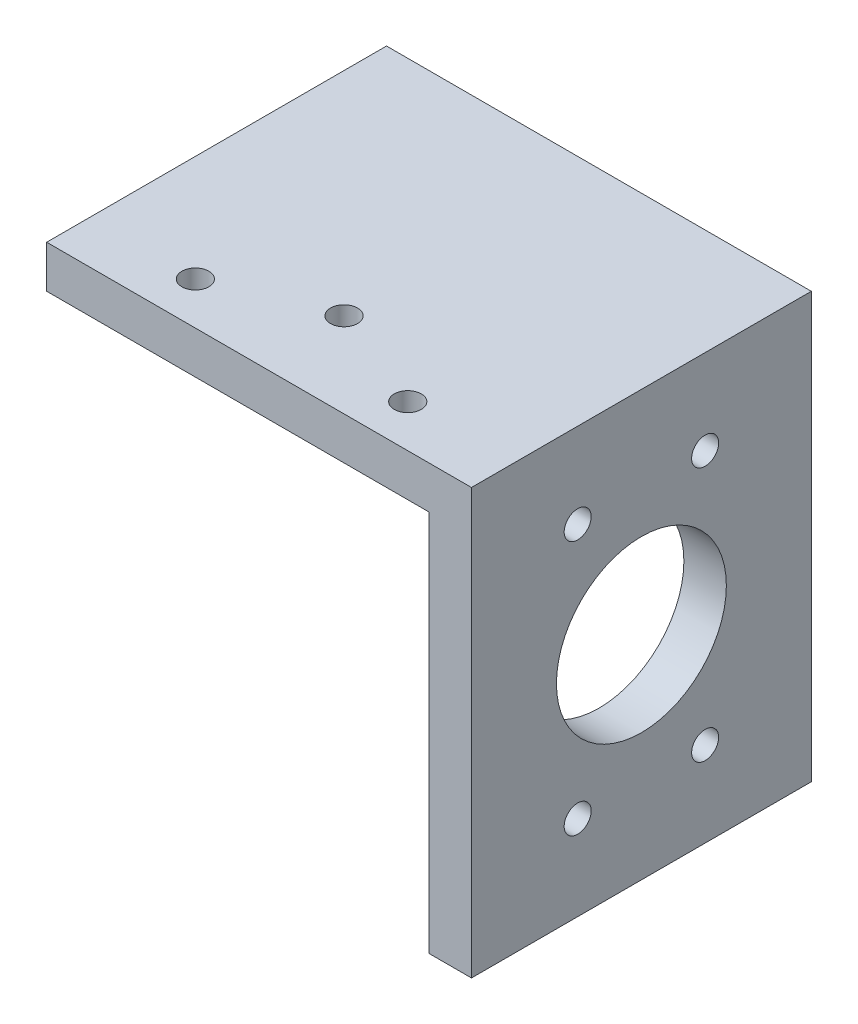
ISO-10303-21;
HEADER;
FILE_DESCRIPTION(('STEP AP214'),'2;1');
FILE_NAME('part.step','',(''),(''),'','','');
FILE_SCHEMA(('AUTOMOTIVE_DESIGN { 1 0 10303 214 1 1 1 1 }'));
ENDSEC;
DATA;
#1=APPLICATION_CONTEXT('core data for automotive mechanical design processes');
#2=APPLICATION_PROTOCOL_DEFINITION('international standard','automotive_design',2000,#1);
#3=PRODUCT_CONTEXT('',#1,'mechanical');
#4=PRODUCT('Part','Part','',(#3));
#5=PRODUCT_RELATED_PRODUCT_CATEGORY('part','',(#4));
#6=PRODUCT_DEFINITION_FORMATION('','',#4);
#7=PRODUCT_DEFINITION_CONTEXT('part definition',#1,'design');
#8=PRODUCT_DEFINITION('design','',#6,#7);
#9=PRODUCT_DEFINITION_SHAPE('','',#8);
#10=(LENGTH_UNIT() NAMED_UNIT(*) SI_UNIT(.MILLI.,.METRE.));
#11=(NAMED_UNIT(*) PLANE_ANGLE_UNIT() SI_UNIT($,.RADIAN.));
#12=(NAMED_UNIT(*) SI_UNIT($,.STERADIAN.) SOLID_ANGLE_UNIT());
#13=UNCERTAINTY_MEASURE_WITH_UNIT(LENGTH_MEASURE(1.E-05),#10,'distance_accuracy_value','');
#14=(GEOMETRIC_REPRESENTATION_CONTEXT(3) GLOBAL_UNCERTAINTY_ASSIGNED_CONTEXT((#13)) GLOBAL_UNIT_ASSIGNED_CONTEXT((#10,
#11,#12)) REPRESENTATION_CONTEXT('',''));
#15=CARTESIAN_POINT('',(0.,0.,0.));
#16=DIRECTION('',(0.,0.,1.));
#17=DIRECTION('',(1.,0.,0.));
#18=AXIS2_PLACEMENT_3D('',#15,#16,#17);
#19=CARTESIAN_POINT('',(0.,0.,50.8));
#20=DIRECTION('',(0.,-1.,0.));
#21=DIRECTION('',(0.,0.,-1.));
#22=AXIS2_PLACEMENT_3D('',#19,#20,#21);
#23=PLANE('',#22);
#24=CARTESIAN_POINT('',(47.625,0.,44.45));
#25=DIRECTION('',(0.,1.,0.));
#26=DIRECTION('',(0.,0.,1.));
#27=AXIS2_PLACEMENT_3D('',#24,#25,#26);
#28=CIRCLE('',#27,2.01929999999999);
#29=CARTESIAN_POINT('',(47.625,0.,46.4693));
#30=VERTEX_POINT('',#29);
#31=EDGE_CURVE('E254',#30,#30,#28,.T.);
#32=ORIENTED_EDGE('',*,*,#31,.F.);
#33=EDGE_LOOP('',(#32));
#34=FACE_BOUND('',#33,.T.);
#35=CARTESIAN_POINT('',(31.75,0.,38.1));
#36=DIRECTION('',(0.,1.,0.));
#37=DIRECTION('',(0.,0.,1.));
#38=AXIS2_PLACEMENT_3D('',#35,#36,#37);
#39=CIRCLE('',#38,2.01929999999999);
#40=CARTESIAN_POINT('',(31.75,0.,40.1193));
#41=VERTEX_POINT('',#40);
#42=EDGE_CURVE('E160',#41,#41,#39,.T.);
#43=ORIENTED_EDGE('',*,*,#42,.F.);
#44=EDGE_LOOP('',(#43));
#45=FACE_BOUND('',#44,.T.);
#46=DIRECTION('',(-1.,0.,0.));
#47=VECTOR('',#46,1.);
#48=CARTESIAN_POINT('',(0.,0.,0.));
#49=LINE('',#48,#47);
#50=CARTESIAN_POINT('',(63.5,0.,0.));
#51=VERTEX_POINT('',#50);
#52=CARTESIAN_POINT('',(0.,0.,0.));
#53=VERTEX_POINT('',#52);
#54=EDGE_CURVE('E82',#51,#53,#49,.T.);
#55=ORIENTED_EDGE('',*,*,#54,.T.);
#56=DIRECTION('',(0.,0.,-1.));
#57=VECTOR('',#56,1.);
#58=CARTESIAN_POINT('',(0.,0.,50.8));
#59=LINE('',#58,#57);
#60=CARTESIAN_POINT('',(0.,0.,50.8));
#61=VERTEX_POINT('',#60);
#62=EDGE_CURVE('E117',#61,#53,#59,.T.);
#63=ORIENTED_EDGE('',*,*,#62,.F.);
#64=DIRECTION('',(-1.,0.,0.));
#65=VECTOR('',#64,1.);
#66=CARTESIAN_POINT('',(0.,0.,50.8));
#67=LINE('',#66,#65);
#68=CARTESIAN_POINT('',(63.5,0.,50.8));
#69=VERTEX_POINT('',#68);
#70=EDGE_CURVE('E53',#69,#61,#67,.T.);
#71=ORIENTED_EDGE('',*,*,#70,.F.);
#72=DIRECTION('',(0.,0.,-1.));
#73=VECTOR('',#72,1.);
#74=CARTESIAN_POINT('',(63.5,0.,50.8));
#75=LINE('',#74,#73);
#76=EDGE_CURVE('E113',#69,#51,#75,.T.);
#77=ORIENTED_EDGE('',*,*,#76,.T.);
#78=EDGE_LOOP('',(#55,#63,#71,#77));
#79=FACE_BOUND('',#78,.T.);
#80=CARTESIAN_POINT('',(15.875,0.,44.45));
#81=DIRECTION('',(0.,1.,0.));
#82=DIRECTION('',(0.,0.,1.));
#83=AXIS2_PLACEMENT_3D('',#80,#81,#82);
#84=CIRCLE('',#83,2.01929999999999);
#85=CARTESIAN_POINT('',(15.875,0.,46.4693));
#86=VERTEX_POINT('',#85);
#87=EDGE_CURVE('E151',#86,#86,#84,.T.);
#88=ORIENTED_EDGE('',*,*,#87,.F.);
#89=EDGE_LOOP('',(#88));
#90=FACE_BOUND('',#89,.T.);
#91=ADVANCED_FACE('F36',(#34,#45,#79,#90),#23,.F.);
#92=CARTESIAN_POINT('',(0.,-6.35,50.8));
#93=DIRECTION('',(1.,0.,0.));
#94=DIRECTION('',(0.,0.,-1.));
#95=AXIS2_PLACEMENT_3D('',#92,#93,#94);
#96=PLANE('',#95);
#97=DIRECTION('',(0.,-1.,0.));
#98=VECTOR('',#97,1.);
#99=CARTESIAN_POINT('',(0.,-6.35,0.));
#100=LINE('',#99,#98);
#101=CARTESIAN_POINT('',(0.,-6.35,0.));
#102=VERTEX_POINT('',#101);
#103=EDGE_CURVE('E121',#53,#102,#100,.T.);
#104=ORIENTED_EDGE('',*,*,#103,.T.);
#105=DIRECTION('',(0.,0.,-1.));
#106=VECTOR('',#105,1.);
#107=CARTESIAN_POINT('',(0.,-6.35,50.8));
#108=LINE('',#107,#106);
#109=CARTESIAN_POINT('',(0.,-6.35,50.8));
#110=VERTEX_POINT('',#109);
#111=EDGE_CURVE('E11',#110,#102,#108,.T.);
#112=ORIENTED_EDGE('',*,*,#111,.F.);
#113=DIRECTION('',(0.,-1.,0.));
#114=VECTOR('',#113,1.);
#115=CARTESIAN_POINT('',(0.,-6.35,50.8));
#116=LINE('',#115,#114);
#117=EDGE_CURVE('E132',#61,#110,#116,.T.);
#118=ORIENTED_EDGE('',*,*,#117,.F.);
#119=ORIENTED_EDGE('',*,*,#62,.T.);
#120=EDGE_LOOP('',(#104,#112,#118,#119));
#121=FACE_BOUND('',#120,.T.);
#122=ADVANCED_FACE('F38',(#121),#96,.F.);
#123=CARTESIAN_POINT('',(57.15,-6.35,50.8));
#124=DIRECTION('',(0.,1.,0.));
#125=DIRECTION('',(-1.,0.,0.));
#126=AXIS2_PLACEMENT_3D('',#123,#124,#125);
#127=PLANE('',#126);
#128=CARTESIAN_POINT('',(47.625,-6.35,44.45));
#129=DIRECTION('',(0.,1.,0.));
#130=DIRECTION('',(-1.,0.,0.));
#131=AXIS2_PLACEMENT_3D('',#128,#129,#130);
#132=CIRCLE('',#131,2.01929999999999);
#133=CARTESIAN_POINT('',(45.6057,-6.35,44.45));
#134=VERTEX_POINT('',#133);
#135=EDGE_CURVE('E251',#134,#134,#132,.T.);
#136=ORIENTED_EDGE('',*,*,#135,.T.);
#137=EDGE_LOOP('',(#136));
#138=FACE_BOUND('',#137,.T.);
#139=CARTESIAN_POINT('',(31.75,-6.35,38.1));
#140=DIRECTION('',(0.,1.,0.));
#141=DIRECTION('',(-1.,0.,0.));
#142=AXIS2_PLACEMENT_3D('',#139,#140,#141);
#143=CIRCLE('',#142,2.01929999999999);
#144=CARTESIAN_POINT('',(29.7307,-6.35,38.1));
#145=VERTEX_POINT('',#144);
#146=EDGE_CURVE('E154',#145,#145,#143,.T.);
#147=ORIENTED_EDGE('',*,*,#146,.T.);
#148=EDGE_LOOP('',(#147));
#149=FACE_BOUND('',#148,.T.);
#150=CARTESIAN_POINT('',(15.875,-6.35,44.45));
#151=DIRECTION('',(0.,1.,0.));
#152=DIRECTION('',(-1.,0.,0.));
#153=AXIS2_PLACEMENT_3D('',#150,#151,#152);
#154=CIRCLE('',#153,2.01929999999999);
#155=CARTESIAN_POINT('',(13.8557,-6.35,44.45));
#156=VERTEX_POINT('',#155);
#157=EDGE_CURVE('E153',#156,#156,#154,.T.);
#158=ORIENTED_EDGE('',*,*,#157,.T.);
#159=EDGE_LOOP('',(#158));
#160=FACE_BOUND('',#159,.T.);
#161=DIRECTION('',(1.,0.,0.));
#162=VECTOR('',#161,1.);
#163=CARTESIAN_POINT('',(57.15,-6.35,0.));
#164=LINE('',#163,#162);
#165=CARTESIAN_POINT('',(57.15,-6.35,0.));
#166=VERTEX_POINT('',#165);
#167=EDGE_CURVE('E124',#102,#166,#164,.T.);
#168=ORIENTED_EDGE('',*,*,#167,.T.);
#169=DIRECTION('',(0.,0.,-1.));
#170=VECTOR('',#169,1.);
#171=CARTESIAN_POINT('',(57.15,-6.35,50.8));
#172=LINE('',#171,#170);
#173=CARTESIAN_POINT('',(57.15,-6.35,50.8));
#174=VERTEX_POINT('',#173);
#175=EDGE_CURVE('E45',#174,#166,#172,.T.);
#176=ORIENTED_EDGE('',*,*,#175,.F.);
#177=DIRECTION('',(1.,0.,0.));
#178=VECTOR('',#177,1.);
#179=CARTESIAN_POINT('',(57.15,-6.35,50.8));
#180=LINE('',#179,#178);
#181=EDGE_CURVE('E90',#110,#174,#180,.T.);
#182=ORIENTED_EDGE('',*,*,#181,.F.);
#183=ORIENTED_EDGE('',*,*,#111,.T.);
#184=EDGE_LOOP('',(#168,#176,#182,#183));
#185=FACE_BOUND('',#184,.T.);
#186=ADVANCED_FACE('F198',(#138,#149,#160,#185),#127,.F.);
#187=CARTESIAN_POINT('',(57.15,-63.5,50.8));
#188=DIRECTION('',(1.,0.,0.));
#189=DIRECTION('',(0.,1.,0.));
#190=AXIS2_PLACEMENT_3D('',#187,#188,#189);
#191=PLANE('',#190);
#192=CARTESIAN_POINT('',(57.15,-50.8,34.925));
#193=DIRECTION('',(1.,0.,0.));
#194=DIRECTION('',(0.,1.,0.));
#195=AXIS2_PLACEMENT_3D('',#192,#193,#194);
#196=CIRCLE('',#195,2.01929999999999);
#197=CARTESIAN_POINT('',(57.15,-48.7807,34.925));
#198=VERTEX_POINT('',#197);
#199=EDGE_CURVE('E166',#198,#198,#196,.T.);
#200=ORIENTED_EDGE('',*,*,#199,.T.);
#201=EDGE_LOOP('',(#200));
#202=FACE_BOUND('',#201,.T.);
#203=CARTESIAN_POINT('',(57.15,-50.8,15.875));
#204=DIRECTION('',(1.,0.,0.));
#205=DIRECTION('',(0.,1.,0.));
#206=AXIS2_PLACEMENT_3D('',#203,#204,#205);
#207=CIRCLE('',#206,2.01929999999999);
#208=CARTESIAN_POINT('',(57.15,-48.7807,15.875));
#209=VERTEX_POINT('',#208);
#210=EDGE_CURVE('E172',#209,#209,#207,.T.);
#211=ORIENTED_EDGE('',*,*,#210,.T.);
#212=EDGE_LOOP('',(#211));
#213=FACE_BOUND('',#212,.T.);
#214=CARTESIAN_POINT('',(57.15,-12.7,34.925));
#215=DIRECTION('',(1.,0.,0.));
#216=DIRECTION('',(0.,1.,0.));
#217=AXIS2_PLACEMENT_3D('',#214,#215,#216);
#218=CIRCLE('',#217,2.01929999999999);
#219=CARTESIAN_POINT('',(57.15,-10.6807,34.925));
#220=VERTEX_POINT('',#219);
#221=EDGE_CURVE('E178',#220,#220,#218,.T.);
#222=ORIENTED_EDGE('',*,*,#221,.T.);
#223=EDGE_LOOP('',(#222));
#224=FACE_BOUND('',#223,.T.);
#225=CARTESIAN_POINT('',(57.15,-12.7,15.875));
#226=DIRECTION('',(1.,0.,0.));
#227=DIRECTION('',(0.,1.,0.));
#228=AXIS2_PLACEMENT_3D('',#225,#226,#227);
#229=CIRCLE('',#228,2.01929999999999);
#230=CARTESIAN_POINT('',(57.15,-10.6807,15.875));
#231=VERTEX_POINT('',#230);
#232=EDGE_CURVE('E184',#231,#231,#229,.T.);
#233=ORIENTED_EDGE('',*,*,#232,.T.);
#234=EDGE_LOOP('',(#233));
#235=FACE_BOUND('',#234,.T.);
#236=CARTESIAN_POINT('',(57.15,-31.75,25.4));
#237=DIRECTION('',(1.,0.,0.));
#238=DIRECTION('',(0.,1.,0.));
#239=AXIS2_PLACEMENT_3D('',#236,#237,#238);
#240=CIRCLE('',#239,12.7);
#241=CARTESIAN_POINT('',(57.15,-19.05,25.4));
#242=VERTEX_POINT('',#241);
#243=EDGE_CURVE('E125',#242,#242,#240,.F.);
#244=ORIENTED_EDGE('',*,*,#243,.F.);
#245=EDGE_LOOP('',(#244));
#246=FACE_BOUND('',#245,.T.);
#247=DIRECTION('',(0.,-1.,0.));
#248=VECTOR('',#247,1.);
#249=CARTESIAN_POINT('',(57.15,-63.5,0.));
#250=LINE('',#249,#248);
#251=CARTESIAN_POINT('',(57.15,-63.5,0.));
#252=VERTEX_POINT('',#251);
#253=EDGE_CURVE('E127',#166,#252,#250,.T.);
#254=ORIENTED_EDGE('',*,*,#253,.T.);
#255=DIRECTION('',(0.,0.,-1.));
#256=VECTOR('',#255,1.);
#257=CARTESIAN_POINT('',(57.15,-63.5,50.8));
#258=LINE('',#257,#256);
#259=CARTESIAN_POINT('',(57.15,-63.5,50.8));
#260=VERTEX_POINT('',#259);
#261=EDGE_CURVE('E112',#260,#252,#258,.T.);
#262=ORIENTED_EDGE('',*,*,#261,.F.);
#263=DIRECTION('',(0.,-1.,0.));
#264=VECTOR('',#263,1.);
#265=CARTESIAN_POINT('',(57.15,-63.5,50.8));
#266=LINE('',#265,#264);
#267=EDGE_CURVE('E103',#174,#260,#266,.T.);
#268=ORIENTED_EDGE('',*,*,#267,.F.);
#269=ORIENTED_EDGE('',*,*,#175,.T.);
#270=EDGE_LOOP('',(#254,#262,#268,#269));
#271=FACE_BOUND('',#270,.T.);
#272=ADVANCED_FACE('F138',(#202,#213,#224,#235,#246,#271),#191,.F.);
#273=CARTESIAN_POINT('',(63.5,-63.5,50.8));
#274=DIRECTION('',(0.,1.,0.));
#275=DIRECTION('',(0.,0.,1.));
#276=AXIS2_PLACEMENT_3D('',#273,#274,#275);
#277=PLANE('',#276);
#278=DIRECTION('',(1.,0.,0.));
#279=VECTOR('',#278,1.);
#280=CARTESIAN_POINT('',(63.5,-63.5,0.));
#281=LINE('',#280,#279);
#282=CARTESIAN_POINT('',(63.5,-63.5,0.));
#283=VERTEX_POINT('',#282);
#284=EDGE_CURVE('E111',#252,#283,#281,.T.);
#285=ORIENTED_EDGE('',*,*,#284,.T.);
#286=DIRECTION('',(0.,0.,-1.));
#287=VECTOR('',#286,1.);
#288=CARTESIAN_POINT('',(63.5,-63.5,50.8));
#289=LINE('',#288,#287);
#290=CARTESIAN_POINT('',(63.5,-63.5,50.8));
#291=VERTEX_POINT('',#290);
#292=EDGE_CURVE('E108',#291,#283,#289,.T.);
#293=ORIENTED_EDGE('',*,*,#292,.F.);
#294=DIRECTION('',(1.,0.,0.));
#295=VECTOR('',#294,1.);
#296=CARTESIAN_POINT('',(63.5,-63.5,50.8));
#297=LINE('',#296,#295);
#298=EDGE_CURVE('E97',#260,#291,#297,.T.);
#299=ORIENTED_EDGE('',*,*,#298,.F.);
#300=ORIENTED_EDGE('',*,*,#261,.T.);
#301=EDGE_LOOP('',(#285,#293,#299,#300));
#302=FACE_BOUND('',#301,.T.);
#303=ADVANCED_FACE('F109',(#302),#277,.F.);
#304=CARTESIAN_POINT('',(63.5,0.,50.8));
#305=DIRECTION('',(-1.,0.,0.));
#306=DIRECTION('',(0.,-1.,0.));
#307=AXIS2_PLACEMENT_3D('',#304,#305,#306);
#308=PLANE('',#307);
#309=CARTESIAN_POINT('',(63.5,-50.8,34.925));
#310=DIRECTION('',(1.,0.,0.));
#311=DIRECTION('',(0.,0.,-1.));
#312=AXIS2_PLACEMENT_3D('',#309,#310,#311);
#313=CIRCLE('',#312,2.01929999999999);
#314=CARTESIAN_POINT('',(63.5,-50.8,32.9057));
#315=VERTEX_POINT('',#314);
#316=EDGE_CURVE('E157',#315,#315,#313,.T.);
#317=ORIENTED_EDGE('',*,*,#316,.F.);
#318=EDGE_LOOP('',(#317));
#319=FACE_BOUND('',#318,.T.);
#320=CARTESIAN_POINT('',(63.5,-50.8,15.875));
#321=DIRECTION('',(1.,0.,0.));
#322=DIRECTION('',(0.,0.,-1.));
#323=AXIS2_PLACEMENT_3D('',#320,#321,#322);
#324=CIRCLE('',#323,2.01929999999999);
#325=CARTESIAN_POINT('',(63.5,-50.8,13.8557));
#326=VERTEX_POINT('',#325);
#327=EDGE_CURVE('E169',#326,#326,#324,.T.);
#328=ORIENTED_EDGE('',*,*,#327,.F.);
#329=EDGE_LOOP('',(#328));
#330=FACE_BOUND('',#329,.T.);
#331=CARTESIAN_POINT('',(63.5,-12.7,34.925));
#332=DIRECTION('',(1.,0.,0.));
#333=DIRECTION('',(0.,0.,-1.));
#334=AXIS2_PLACEMENT_3D('',#331,#332,#333);
#335=CIRCLE('',#334,2.01929999999999);
#336=CARTESIAN_POINT('',(63.5,-12.7,32.9057));
#337=VERTEX_POINT('',#336);
#338=EDGE_CURVE('E175',#337,#337,#335,.T.);
#339=ORIENTED_EDGE('',*,*,#338,.F.);
#340=EDGE_LOOP('',(#339));
#341=FACE_BOUND('',#340,.T.);
#342=CARTESIAN_POINT('',(63.5,-12.7,15.875));
#343=DIRECTION('',(1.,0.,0.));
#344=DIRECTION('',(0.,0.,-1.));
#345=AXIS2_PLACEMENT_3D('',#342,#343,#344);
#346=CIRCLE('',#345,2.01929999999999);
#347=CARTESIAN_POINT('',(63.5,-12.7,13.8557));
#348=VERTEX_POINT('',#347);
#349=EDGE_CURVE('E181',#348,#348,#346,.T.);
#350=ORIENTED_EDGE('',*,*,#349,.F.);
#351=EDGE_LOOP('',(#350));
#352=FACE_BOUND('',#351,.T.);
#353=CARTESIAN_POINT('',(63.5,-31.75,25.4));
#354=DIRECTION('',(1.,0.,0.));
#355=DIRECTION('',(0.,1.,0.));
#356=AXIS2_PLACEMENT_3D('',#353,#354,#355);
#357=CIRCLE('',#356,12.7);
#358=CARTESIAN_POINT('',(63.5,-19.05,25.4));
#359=VERTEX_POINT('',#358);
#360=EDGE_CURVE('E187',#359,#359,#357,.T.);
#361=ORIENTED_EDGE('',*,*,#360,.F.);
#362=EDGE_LOOP('',(#361));
#363=FACE_BOUND('',#362,.T.);
#364=DIRECTION('',(0.,1.,0.));
#365=VECTOR('',#364,1.);
#366=CARTESIAN_POINT('',(63.5,0.,0.));
#367=LINE('',#366,#365);
#368=EDGE_CURVE('E76',#283,#51,#367,.T.);
#369=ORIENTED_EDGE('',*,*,#368,.T.);
#370=ORIENTED_EDGE('',*,*,#76,.F.);
#371=DIRECTION('',(0.,1.,0.));
#372=VECTOR('',#371,1.);
#373=CARTESIAN_POINT('',(63.5,0.,50.8));
#374=LINE('',#373,#372);
#375=EDGE_CURVE('E101',#291,#69,#374,.T.);
#376=ORIENTED_EDGE('',*,*,#375,.F.);
#377=ORIENTED_EDGE('',*,*,#292,.T.);
#378=EDGE_LOOP('',(#369,#370,#376,#377));
#379=FACE_BOUND('',#378,.T.);
#380=ADVANCED_FACE('F115',(#319,#330,#341,#352,#363,#379),#308,.F.);
#381=CARTESIAN_POINT('',(0.,0.,50.8));
#382=DIRECTION('',(0.,0.,-1.));
#383=DIRECTION('',(-1.,0.,0.));
#384=AXIS2_PLACEMENT_3D('',#381,#382,#383);
#385=PLANE('',#384);
#386=ORIENTED_EDGE('',*,*,#117,.T.);
#387=ORIENTED_EDGE('',*,*,#181,.T.);
#388=ORIENTED_EDGE('',*,*,#267,.T.);
#389=ORIENTED_EDGE('',*,*,#298,.T.);
#390=ORIENTED_EDGE('',*,*,#375,.T.);
#391=ORIENTED_EDGE('',*,*,#70,.T.);
#392=EDGE_LOOP('',(#386,#387,#388,#389,#390,#391));
#393=FACE_BOUND('',#392,.T.);
#394=ADVANCED_FACE('F99',(#393),#385,.F.);
#395=CARTESIAN_POINT('',(0.,0.,0.));
#396=DIRECTION('',(0.,0.,-1.));
#397=DIRECTION('',(-1.,0.,0.));
#398=AXIS2_PLACEMENT_3D('',#395,#396,#397);
#399=PLANE('',#398);
#400=ORIENTED_EDGE('',*,*,#103,.F.);
#401=ORIENTED_EDGE('',*,*,#54,.F.);
#402=ORIENTED_EDGE('',*,*,#368,.F.);
#403=ORIENTED_EDGE('',*,*,#284,.F.);
#404=ORIENTED_EDGE('',*,*,#253,.F.);
#405=ORIENTED_EDGE('',*,*,#167,.F.);
#406=EDGE_LOOP('',(#400,#401,#402,#403,#404,#405));
#407=FACE_BOUND('',#406,.T.);
#408=ADVANCED_FACE('F141',(#407),#399,.T.);
#409=CARTESIAN_POINT('',(-0.00100000000001488,-31.75,25.4));
#410=DIRECTION('',(1.,0.,0.));
#411=DIRECTION('',(0.,1.,0.));
#412=AXIS2_PLACEMENT_3D('',#409,#410,#411);
#413=CYLINDRICAL_SURFACE('',#412,12.7);
#414=ORIENTED_EDGE('',*,*,#360,.T.);
#415=EDGE_LOOP('',(#414));
#416=FACE_BOUND('',#415,.T.);
#417=ORIENTED_EDGE('',*,*,#243,.T.);
#418=EDGE_LOOP('',(#417));
#419=FACE_BOUND('',#418,.T.);
#420=ADVANCED_FACE('F195',(#416,#419),#413,.F.);
#421=CARTESIAN_POINT('',(63.5,-12.7,15.875));
#422=DIRECTION('',(1.,0.,0.));
#423=DIRECTION('',(0.,0.,-1.));
#424=AXIS2_PLACEMENT_3D('',#421,#422,#423);
#425=CYLINDRICAL_SURFACE('',#424,2.01929999999999);
#426=ORIENTED_EDGE('',*,*,#232,.F.);
#427=EDGE_LOOP('',(#426));
#428=FACE_BOUND('',#427,.T.);
#429=ORIENTED_EDGE('',*,*,#349,.T.);
#430=EDGE_LOOP('',(#429));
#431=FACE_BOUND('',#430,.T.);
#432=ADVANCED_FACE('F218',(#428,#431),#425,.F.);
#433=CARTESIAN_POINT('',(63.5,-12.7,34.925));
#434=DIRECTION('',(1.,0.,0.));
#435=DIRECTION('',(0.,0.,-1.));
#436=AXIS2_PLACEMENT_3D('',#433,#434,#435);
#437=CYLINDRICAL_SURFACE('',#436,2.01929999999999);
#438=ORIENTED_EDGE('',*,*,#221,.F.);
#439=EDGE_LOOP('',(#438));
#440=FACE_BOUND('',#439,.T.);
#441=ORIENTED_EDGE('',*,*,#338,.T.);
#442=EDGE_LOOP('',(#441));
#443=FACE_BOUND('',#442,.T.);
#444=ADVANCED_FACE('F222',(#440,#443),#437,.F.);
#445=CARTESIAN_POINT('',(63.5,-50.8,15.875));
#446=DIRECTION('',(1.,0.,0.));
#447=DIRECTION('',(0.,0.,-1.));
#448=AXIS2_PLACEMENT_3D('',#445,#446,#447);
#449=CYLINDRICAL_SURFACE('',#448,2.01929999999999);
#450=ORIENTED_EDGE('',*,*,#210,.F.);
#451=EDGE_LOOP('',(#450));
#452=FACE_BOUND('',#451,.T.);
#453=ORIENTED_EDGE('',*,*,#327,.T.);
#454=EDGE_LOOP('',(#453));
#455=FACE_BOUND('',#454,.T.);
#456=ADVANCED_FACE('F226',(#452,#455),#449,.F.);
#457=CARTESIAN_POINT('',(63.5,-50.8,34.925));
#458=DIRECTION('',(1.,0.,0.));
#459=DIRECTION('',(0.,0.,-1.));
#460=AXIS2_PLACEMENT_3D('',#457,#458,#459);
#461=CYLINDRICAL_SURFACE('',#460,2.01929999999999);
#462=ORIENTED_EDGE('',*,*,#199,.F.);
#463=EDGE_LOOP('',(#462));
#464=FACE_BOUND('',#463,.T.);
#465=ORIENTED_EDGE('',*,*,#316,.T.);
#466=EDGE_LOOP('',(#465));
#467=FACE_BOUND('',#466,.T.);
#468=ADVANCED_FACE('F230',(#464,#467),#461,.F.);
#469=CARTESIAN_POINT('',(15.875,0.,44.45));
#470=DIRECTION('',(0.,1.,0.));
#471=DIRECTION('',(0.,0.,1.));
#472=AXIS2_PLACEMENT_3D('',#469,#470,#471);
#473=CYLINDRICAL_SURFACE('',#472,2.01929999999999);
#474=ORIENTED_EDGE('',*,*,#157,.F.);
#475=EDGE_LOOP('',(#474));
#476=FACE_BOUND('',#475,.T.);
#477=ORIENTED_EDGE('',*,*,#87,.T.);
#478=EDGE_LOOP('',(#477));
#479=FACE_BOUND('',#478,.T.);
#480=ADVANCED_FACE('F234',(#476,#479),#473,.F.);
#481=CARTESIAN_POINT('',(31.75,0.,38.1));
#482=DIRECTION('',(0.,1.,0.));
#483=DIRECTION('',(0.,0.,1.));
#484=AXIS2_PLACEMENT_3D('',#481,#482,#483);
#485=CYLINDRICAL_SURFACE('',#484,2.01929999999999);
#486=ORIENTED_EDGE('',*,*,#146,.F.);
#487=EDGE_LOOP('',(#486));
#488=FACE_BOUND('',#487,.T.);
#489=ORIENTED_EDGE('',*,*,#42,.T.);
#490=EDGE_LOOP('',(#489));
#491=FACE_BOUND('',#490,.T.);
#492=ADVANCED_FACE('F238',(#488,#491),#485,.F.);
#493=CARTESIAN_POINT('',(47.625,0.,44.45));
#494=DIRECTION('',(0.,1.,0.));
#495=DIRECTION('',(0.,0.,1.));
#496=AXIS2_PLACEMENT_3D('',#493,#494,#495);
#497=CYLINDRICAL_SURFACE('',#496,2.01929999999999);
#498=ORIENTED_EDGE('',*,*,#135,.F.);
#499=EDGE_LOOP('',(#498));
#500=FACE_BOUND('',#499,.T.);
#501=ORIENTED_EDGE('',*,*,#31,.T.);
#502=EDGE_LOOP('',(#501));
#503=FACE_BOUND('',#502,.T.);
#504=ADVANCED_FACE('F242',(#500,#503),#497,.F.);
#505=CLOSED_SHELL('',(#91,#122,#186,#272,#303,#380,#394,#408,#420,#432,#444,#456,#468,#480,#492,#504));
#506=MANIFOLD_SOLID_BREP('B2',#505);
#507=ADVANCED_BREP_SHAPE_REPRESENTATION('',(#18,#506),#14);
#508=SHAPE_DEFINITION_REPRESENTATION(#9,#507);
ENDSEC;
END-ISO-10303-21;
